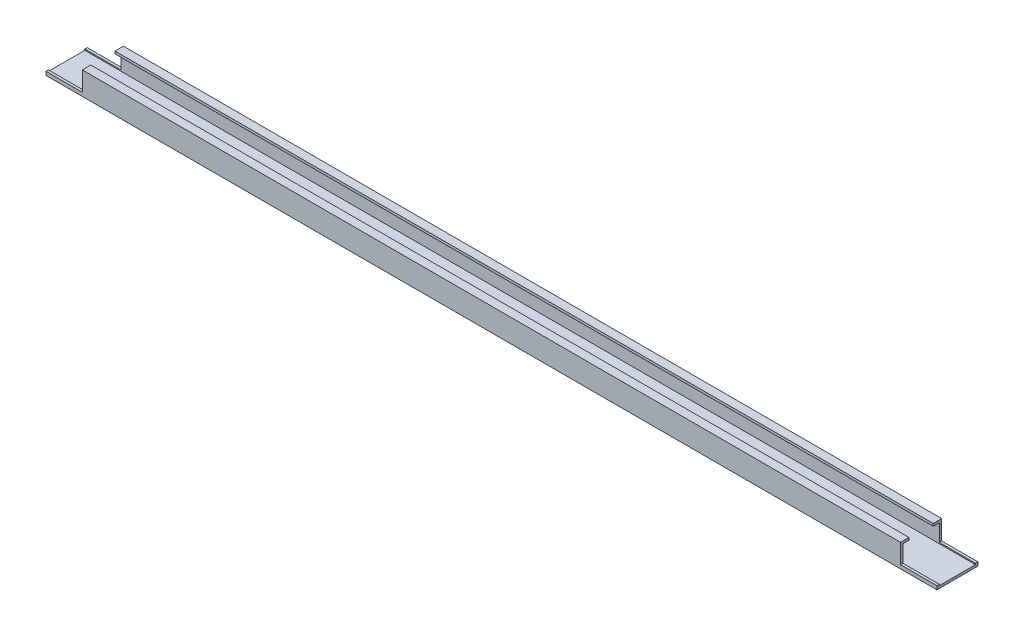
ISO-10303-21;
HEADER;
FILE_DESCRIPTION(('STEP AP214'),'2;1');
FILE_NAME('part.step','',(''),(''),'','','');
FILE_SCHEMA(('AUTOMOTIVE_DESIGN { 1 0 10303 214 1 1 1 1 }'));
ENDSEC;
DATA;
#1=APPLICATION_CONTEXT('core data for automotive mechanical design processes');
#2=APPLICATION_PROTOCOL_DEFINITION('international standard','automotive_design',2000,#1);
#3=PRODUCT_CONTEXT('',#1,'mechanical');
#4=PRODUCT('Part','Part','',(#3));
#5=PRODUCT_RELATED_PRODUCT_CATEGORY('part','',(#4));
#6=PRODUCT_DEFINITION_FORMATION('','',#4);
#7=PRODUCT_DEFINITION_CONTEXT('part definition',#1,'design');
#8=PRODUCT_DEFINITION('design','',#6,#7);
#9=PRODUCT_DEFINITION_SHAPE('','',#8);
#10=(LENGTH_UNIT() NAMED_UNIT(*) SI_UNIT(.MILLI.,.METRE.));
#11=(NAMED_UNIT(*) PLANE_ANGLE_UNIT() SI_UNIT($,.RADIAN.));
#12=(NAMED_UNIT(*) SI_UNIT($,.STERADIAN.) SOLID_ANGLE_UNIT());
#13=UNCERTAINTY_MEASURE_WITH_UNIT(LENGTH_MEASURE(1.E-05),#10,'distance_accuracy_value','');
#14=(GEOMETRIC_REPRESENTATION_CONTEXT(3) GLOBAL_UNCERTAINTY_ASSIGNED_CONTEXT((#13)) GLOBAL_UNIT_ASSIGNED_CONTEXT((#10,
#11,#12)) REPRESENTATION_CONTEXT('',''));
#15=CARTESIAN_POINT('',(0.,0.,0.));
#16=DIRECTION('',(0.,0.,1.));
#17=DIRECTION('',(1.,0.,0.));
#18=AXIS2_PLACEMENT_3D('',#15,#16,#17);
#19=CARTESIAN_POINT('',(736.,17.,-15.));
#20=DIRECTION('',(0.,-1.,0.));
#21=DIRECTION('',(0.,0.,-1.));
#22=AXIS2_PLACEMENT_3D('',#19,#20,#21);
#23=PLANE('',#22);
#24=DIRECTION('',(-1.,0.,0.));
#25=VECTOR('',#24,1.);
#26=CARTESIAN_POINT('',(736.,17.,-10.));
#27=LINE('',#26,#25);
#28=CARTESIAN_POINT('',(706.,17.,-10.));
#29=VERTEX_POINT('',#28);
#30=CARTESIAN_POINT('',(30.,17.,-10.));
#31=VERTEX_POINT('',#30);
#32=EDGE_CURVE('E311',#29,#31,#27,.T.);
#33=ORIENTED_EDGE('',*,*,#32,.F.);
#34=DIRECTION('',(0.,0.,-1.));
#35=VECTOR('',#34,1.);
#36=CARTESIAN_POINT('',(706.,17.,17.));
#37=LINE('',#36,#35);
#38=CARTESIAN_POINT('',(706.,17.,-17.));
#39=VERTEX_POINT('',#38);
#40=EDGE_CURVE('E174',#29,#39,#37,.T.);
#41=ORIENTED_EDGE('',*,*,#40,.T.);
#42=DIRECTION('',(-1.,0.,0.));
#43=VECTOR('',#42,1.);
#44=CARTESIAN_POINT('',(736.,17.,-17.));
#45=LINE('',#44,#43);
#46=CARTESIAN_POINT('',(30.,17.,-17.));
#47=VERTEX_POINT('',#46);
#48=EDGE_CURVE('E267',#39,#47,#45,.T.);
#49=ORIENTED_EDGE('',*,*,#48,.T.);
#50=DIRECTION('',(0.,0.,-1.));
#51=VECTOR('',#50,1.);
#52=CARTESIAN_POINT('',(30.,17.,17.));
#53=LINE('',#52,#51);
#54=EDGE_CURVE('E209',#31,#47,#53,.T.);
#55=ORIENTED_EDGE('',*,*,#54,.F.);
#56=EDGE_LOOP('',(#33,#41,#49,#55));
#57=FACE_BOUND('',#56,.T.);
#58=ADVANCED_FACE('F33',(#57),#23,.F.);
#59=CARTESIAN_POINT('',(736.,15.,-10.));
#60=DIRECTION('',(0.,0.,1.));
#61=DIRECTION('',(1.,0.,0.));
#62=AXIS2_PLACEMENT_3D('',#59,#60,#61);
#63=PLANE('',#62);
#64=DIRECTION('',(0.,-1.,0.));
#65=VECTOR('',#64,1.);
#66=CARTESIAN_POINT('',(706.,15.,-10.));
#67=LINE('',#66,#65);
#68=CARTESIAN_POINT('',(706.,15.,-10.));
#69=VERTEX_POINT('',#68);
#70=EDGE_CURVE('E249',#29,#69,#67,.T.);
#71=ORIENTED_EDGE('',*,*,#70,.F.);
#72=ORIENTED_EDGE('',*,*,#32,.T.);
#73=DIRECTION('',(0.,1.,0.));
#74=VECTOR('',#73,1.);
#75=CARTESIAN_POINT('',(30.,15.0000000000002,-10.));
#76=LINE('',#75,#74);
#77=CARTESIAN_POINT('',(30.,15.,-10.));
#78=VERTEX_POINT('',#77);
#79=EDGE_CURVE('E237',#78,#31,#76,.T.);
#80=ORIENTED_EDGE('',*,*,#79,.F.);
#81=DIRECTION('',(-1.,0.,0.));
#82=VECTOR('',#81,1.);
#83=CARTESIAN_POINT('',(736.,15.,-10.));
#84=LINE('',#83,#82);
#85=EDGE_CURVE('E308',#69,#78,#84,.T.);
#86=ORIENTED_EDGE('',*,*,#85,.F.);
#87=EDGE_LOOP('',(#71,#72,#80,#86));
#88=FACE_BOUND('',#87,.T.);
#89=ADVANCED_FACE('F354',(#88),#63,.T.);
#90=CARTESIAN_POINT('',(736.,15.,-15.));
#91=DIRECTION('',(0.,-1.,0.));
#92=DIRECTION('',(0.,0.,-1.));
#93=AXIS2_PLACEMENT_3D('',#90,#91,#92);
#94=PLANE('',#93);
#95=DIRECTION('',(0.,0.,-1.));
#96=VECTOR('',#95,1.);
#97=CARTESIAN_POINT('',(706.,15.,-15.));
#98=LINE('',#97,#96);
#99=CARTESIAN_POINT('',(706.,15.,-15.));
#100=VERTEX_POINT('',#99);
#101=EDGE_CURVE('E247',#69,#100,#98,.T.);
#102=ORIENTED_EDGE('',*,*,#101,.F.);
#103=ORIENTED_EDGE('',*,*,#85,.T.);
#104=DIRECTION('',(0.,0.,1.));
#105=VECTOR('',#104,1.);
#106=CARTESIAN_POINT('',(30.,15.,-15.));
#107=LINE('',#106,#105);
#108=CARTESIAN_POINT('',(30.,15.,-15.));
#109=VERTEX_POINT('',#108);
#110=EDGE_CURVE('E235',#109,#78,#107,.T.);
#111=ORIENTED_EDGE('',*,*,#110,.F.);
#112=DIRECTION('',(-1.,0.,0.));
#113=VECTOR('',#112,1.);
#114=CARTESIAN_POINT('',(736.,15.,-15.));
#115=LINE('',#114,#113);
#116=EDGE_CURVE('E305',#100,#109,#115,.T.);
#117=ORIENTED_EDGE('',*,*,#116,.F.);
#118=EDGE_LOOP('',(#102,#103,#111,#117));
#119=FACE_BOUND('',#118,.T.);
#120=ADVANCED_FACE('F359',(#119),#94,.T.);
#121=CARTESIAN_POINT('',(736.,0.,-15.));
#122=DIRECTION('',(0.,0.,1.));
#123=DIRECTION('',(1.,0.,0.));
#124=AXIS2_PLACEMENT_3D('',#121,#122,#123);
#125=PLANE('',#124);
#126=DIRECTION('',(0.,-1.,0.));
#127=VECTOR('',#126,1.);
#128=CARTESIAN_POINT('',(706.,0.,-15.));
#129=LINE('',#128,#127);
#130=CARTESIAN_POINT('',(706.,1.,-15.));
#131=VERTEX_POINT('',#130);
#132=EDGE_CURVE('E245',#100,#131,#129,.T.);
#133=ORIENTED_EDGE('',*,*,#132,.F.);
#134=ORIENTED_EDGE('',*,*,#116,.T.);
#135=DIRECTION('',(0.,1.,0.));
#136=VECTOR('',#135,1.);
#137=CARTESIAN_POINT('',(30.,1.53089346754953E-13,-15.));
#138=LINE('',#137,#136);
#139=CARTESIAN_POINT('',(30.,0.999999999999997,-15.));
#140=VERTEX_POINT('',#139);
#141=EDGE_CURVE('E233',#140,#109,#138,.T.);
#142=ORIENTED_EDGE('',*,*,#141,.F.);
#143=DIRECTION('',(1.,0.,0.));
#144=VECTOR('',#143,1.);
#145=CARTESIAN_POINT('',(736.,0.999999999999911,-15.));
#146=LINE('',#145,#144);
#147=CARTESIAN_POINT('',(0.,1.,-15.));
#148=VERTEX_POINT('',#147);
#149=EDGE_CURVE('E223',#148,#140,#146,.T.);
#150=ORIENTED_EDGE('',*,*,#149,.F.);
#151=DIRECTION('',(0.,1.,0.));
#152=VECTOR('',#151,1.);
#153=CARTESIAN_POINT('',(0.,0.,-15.));
#154=LINE('',#153,#152);
#155=CARTESIAN_POINT('',(0.,0.,-15.));
#156=VERTEX_POINT('',#155);
#157=EDGE_CURVE('E251',#156,#148,#154,.T.);
#158=ORIENTED_EDGE('',*,*,#157,.F.);
#159=DIRECTION('',(-1.,0.,0.));
#160=VECTOR('',#159,1.);
#161=CARTESIAN_POINT('',(736.,0.,-15.));
#162=LINE('',#161,#160);
#163=CARTESIAN_POINT('',(736.,0.,-15.));
#164=VERTEX_POINT('',#163);
#165=EDGE_CURVE('E303',#164,#156,#162,.T.);
#166=ORIENTED_EDGE('',*,*,#165,.F.);
#167=DIRECTION('',(0.,1.,0.));
#168=VECTOR('',#167,1.);
#169=CARTESIAN_POINT('',(736.,0.,-15.));
#170=LINE('',#169,#168);
#171=CARTESIAN_POINT('',(736.,1.,-15.));
#172=VERTEX_POINT('',#171);
#173=EDGE_CURVE('E252',#164,#172,#170,.T.);
#174=ORIENTED_EDGE('',*,*,#173,.T.);
#175=DIRECTION('',(1.,0.,0.));
#176=VECTOR('',#175,1.);
#177=CARTESIAN_POINT('',(736.,1.,-15.));
#178=LINE('',#177,#176);
#179=EDGE_CURVE('E55',#131,#172,#178,.T.);
#180=ORIENTED_EDGE('',*,*,#179,.F.);
#181=EDGE_LOOP('',(#133,#134,#142,#150,#158,#166,#174,#180));
#182=FACE_BOUND('',#181,.T.);
#183=ADVANCED_FACE('F325',(#182),#125,.T.);
#184=CARTESIAN_POINT('',(736.,0.,15.));
#185=DIRECTION('',(0.,1.,0.));
#186=DIRECTION('',(0.,0.,1.));
#187=AXIS2_PLACEMENT_3D('',#184,#185,#186);
#188=PLANE('',#187);
#189=DIRECTION('',(0.,0.,-1.));
#190=VECTOR('',#189,1.);
#191=CARTESIAN_POINT('',(0.,0.,15.));
#192=LINE('',#191,#190);
#193=CARTESIAN_POINT('',(0.,0.,15.));
#194=VERTEX_POINT('',#193);
#195=EDGE_CURVE('E270',#194,#156,#192,.T.);
#196=ORIENTED_EDGE('',*,*,#195,.F.);
#197=DIRECTION('',(-1.,0.,0.));
#198=VECTOR('',#197,1.);
#199=CARTESIAN_POINT('',(736.,0.,15.));
#200=LINE('',#199,#198);
#201=CARTESIAN_POINT('',(736.,0.,15.));
#202=VERTEX_POINT('',#201);
#203=EDGE_CURVE('E300',#202,#194,#200,.T.);
#204=ORIENTED_EDGE('',*,*,#203,.F.);
#205=DIRECTION('',(0.,0.,-1.));
#206=VECTOR('',#205,1.);
#207=CARTESIAN_POINT('',(736.,0.,15.));
#208=LINE('',#207,#206);
#209=EDGE_CURVE('E255',#202,#164,#208,.T.);
#210=ORIENTED_EDGE('',*,*,#209,.T.);
#211=ORIENTED_EDGE('',*,*,#165,.T.);
#212=EDGE_LOOP('',(#196,#204,#210,#211));
#213=FACE_BOUND('',#212,.T.);
#214=ADVANCED_FACE('F331',(#213),#188,.T.);
#215=CARTESIAN_POINT('',(736.,0.,15.));
#216=DIRECTION('',(0.,0.,-1.));
#217=DIRECTION('',(-1.,0.,0.));
#218=AXIS2_PLACEMENT_3D('',#215,#216,#217);
#219=PLANE('',#218);
#220=DIRECTION('',(0.,1.,0.));
#221=VECTOR('',#220,1.);
#222=CARTESIAN_POINT('',(706.,0.,15.));
#223=LINE('',#222,#221);
#224=CARTESIAN_POINT('',(706.,1.,15.));
#225=VERTEX_POINT('',#224);
#226=CARTESIAN_POINT('',(706.,15.,15.));
#227=VERTEX_POINT('',#226);
#228=EDGE_CURVE('E243',#225,#227,#223,.T.);
#229=ORIENTED_EDGE('',*,*,#228,.F.);
#230=DIRECTION('',(-1.,0.,0.));
#231=VECTOR('',#230,1.);
#232=CARTESIAN_POINT('',(736.,1.,15.));
#233=LINE('',#232,#231);
#234=CARTESIAN_POINT('',(736.,1.,15.));
#235=VERTEX_POINT('',#234);
#236=EDGE_CURVE('E171',#235,#225,#233,.T.);
#237=ORIENTED_EDGE('',*,*,#236,.F.);
#238=DIRECTION('',(0.,-1.,0.));
#239=VECTOR('',#238,1.);
#240=CARTESIAN_POINT('',(736.,0.,15.));
#241=LINE('',#240,#239);
#242=EDGE_CURVE('E259',#235,#202,#241,.T.);
#243=ORIENTED_EDGE('',*,*,#242,.T.);
#244=ORIENTED_EDGE('',*,*,#203,.T.);
#245=DIRECTION('',(0.,-1.,0.));
#246=VECTOR('',#245,1.);
#247=CARTESIAN_POINT('',(0.,0.,15.));
#248=LINE('',#247,#246);
#249=CARTESIAN_POINT('',(0.,1.,15.));
#250=VERTEX_POINT('',#249);
#251=EDGE_CURVE('E273',#250,#194,#248,.T.);
#252=ORIENTED_EDGE('',*,*,#251,.F.);
#253=DIRECTION('',(-1.,0.,0.));
#254=VECTOR('',#253,1.);
#255=CARTESIAN_POINT('',(736.,0.999999999999911,15.));
#256=LINE('',#255,#254);
#257=CARTESIAN_POINT('',(30.,0.999999999999997,15.));
#258=VERTEX_POINT('',#257);
#259=EDGE_CURVE('E199',#258,#250,#256,.T.);
#260=ORIENTED_EDGE('',*,*,#259,.F.);
#261=DIRECTION('',(0.,-1.,0.));
#262=VECTOR('',#261,1.);
#263=CARTESIAN_POINT('',(30.,1.53089346754953E-13,15.));
#264=LINE('',#263,#262);
#265=CARTESIAN_POINT('',(30.,15.,15.));
#266=VERTEX_POINT('',#265);
#267=EDGE_CURVE('E231',#266,#258,#264,.T.);
#268=ORIENTED_EDGE('',*,*,#267,.F.);
#269=DIRECTION('',(-1.,0.,0.));
#270=VECTOR('',#269,1.);
#271=CARTESIAN_POINT('',(736.,15.,15.));
#272=LINE('',#271,#270);
#273=EDGE_CURVE('E297',#227,#266,#272,.T.);
#274=ORIENTED_EDGE('',*,*,#273,.F.);
#275=EDGE_LOOP('',(#229,#237,#243,#244,#252,#260,#268,#274));
#276=FACE_BOUND('',#275,.T.);
#277=ADVANCED_FACE('F374',(#276),#219,.T.);
#278=CARTESIAN_POINT('',(736.,15.,15.));
#279=DIRECTION('',(0.,-1.,0.));
#280=DIRECTION('',(0.,0.,-1.));
#281=AXIS2_PLACEMENT_3D('',#278,#279,#280);
#282=PLANE('',#281);
#283=DIRECTION('',(0.,0.,-1.));
#284=VECTOR('',#283,1.);
#285=CARTESIAN_POINT('',(706.,15.,15.));
#286=LINE('',#285,#284);
#287=CARTESIAN_POINT('',(706.,15.,10.));
#288=VERTEX_POINT('',#287);
#289=EDGE_CURVE('E241',#227,#288,#286,.T.);
#290=ORIENTED_EDGE('',*,*,#289,.F.);
#291=ORIENTED_EDGE('',*,*,#273,.T.);
#292=DIRECTION('',(0.,0.,1.));
#293=VECTOR('',#292,1.);
#294=CARTESIAN_POINT('',(30.,15.,15.));
#295=LINE('',#294,#293);
#296=CARTESIAN_POINT('',(30.,15.,10.));
#297=VERTEX_POINT('',#296);
#298=EDGE_CURVE('E229',#297,#266,#295,.T.);
#299=ORIENTED_EDGE('',*,*,#298,.F.);
#300=DIRECTION('',(-1.,0.,0.));
#301=VECTOR('',#300,1.);
#302=CARTESIAN_POINT('',(736.,15.,10.));
#303=LINE('',#302,#301);
#304=EDGE_CURVE('E294',#288,#297,#303,.T.);
#305=ORIENTED_EDGE('',*,*,#304,.F.);
#306=EDGE_LOOP('',(#290,#291,#299,#305));
#307=FACE_BOUND('',#306,.T.);
#308=ADVANCED_FACE('F381',(#307),#282,.T.);
#309=CARTESIAN_POINT('',(736.,17.,10.));
#310=DIRECTION('',(0.,0.,-1.));
#311=DIRECTION('',(-1.,0.,0.));
#312=AXIS2_PLACEMENT_3D('',#309,#310,#311);
#313=PLANE('',#312);
#314=DIRECTION('',(0.,1.,0.));
#315=VECTOR('',#314,1.);
#316=CARTESIAN_POINT('',(706.,17.,10.));
#317=LINE('',#316,#315);
#318=CARTESIAN_POINT('',(706.,17.,10.));
#319=VERTEX_POINT('',#318);
#320=EDGE_CURVE('E239',#288,#319,#317,.T.);
#321=ORIENTED_EDGE('',*,*,#320,.F.);
#322=ORIENTED_EDGE('',*,*,#304,.T.);
#323=DIRECTION('',(0.,-1.,0.));
#324=VECTOR('',#323,1.);
#325=CARTESIAN_POINT('',(30.,17.0000000000002,10.));
#326=LINE('',#325,#324);
#327=CARTESIAN_POINT('',(30.,17.,10.));
#328=VERTEX_POINT('',#327);
#329=EDGE_CURVE('E227',#328,#297,#326,.T.);
#330=ORIENTED_EDGE('',*,*,#329,.F.);
#331=DIRECTION('',(-1.,0.,0.));
#332=VECTOR('',#331,1.);
#333=CARTESIAN_POINT('',(736.,17.,10.));
#334=LINE('',#333,#332);
#335=EDGE_CURVE('E291',#319,#328,#334,.T.);
#336=ORIENTED_EDGE('',*,*,#335,.F.);
#337=EDGE_LOOP('',(#321,#322,#330,#336));
#338=FACE_BOUND('',#337,.T.);
#339=ADVANCED_FACE('F385',(#338),#313,.T.);
#340=CARTESIAN_POINT('',(736.,17.,15.));
#341=DIRECTION('',(0.,-1.,0.));
#342=DIRECTION('',(0.,0.,-1.));
#343=AXIS2_PLACEMENT_3D('',#340,#341,#342);
#344=PLANE('',#343);
#345=DIRECTION('',(-1.,0.,0.));
#346=VECTOR('',#345,1.);
#347=CARTESIAN_POINT('',(736.,17.,17.));
#348=LINE('',#347,#346);
#349=CARTESIAN_POINT('',(706.,17.,17.));
#350=VERTEX_POINT('',#349);
#351=CARTESIAN_POINT('',(30.,17.,17.));
#352=VERTEX_POINT('',#351);
#353=EDGE_CURVE('E289',#350,#352,#348,.T.);
#354=ORIENTED_EDGE('',*,*,#353,.F.);
#355=EDGE_CURVE('E181',#350,#319,#37,.T.);
#356=ORIENTED_EDGE('',*,*,#355,.T.);
#357=ORIENTED_EDGE('',*,*,#335,.T.);
#358=EDGE_CURVE('E220',#352,#328,#53,.T.);
#359=ORIENTED_EDGE('',*,*,#358,.F.);
#360=EDGE_LOOP('',(#354,#356,#357,#359));
#361=FACE_BOUND('',#360,.T.);
#362=ADVANCED_FACE('F388',(#361),#344,.F.);
#363=CARTESIAN_POINT('',(736.,0.,17.));
#364=DIRECTION('',(0.,0.,-1.));
#365=DIRECTION('',(-1.,0.,0.));
#366=AXIS2_PLACEMENT_3D('',#363,#364,#365);
#367=PLANE('',#366);
#368=DIRECTION('',(-1.,0.,0.));
#369=VECTOR('',#368,1.);
#370=CARTESIAN_POINT('',(736.,1.,17.));
#371=LINE('',#370,#369);
#372=CARTESIAN_POINT('',(736.,1.,17.));
#373=VERTEX_POINT('',#372);
#374=CARTESIAN_POINT('',(706.,1.,17.));
#375=VERTEX_POINT('',#374);
#376=EDGE_CURVE('E47',#373,#375,#371,.T.);
#377=ORIENTED_EDGE('',*,*,#376,.T.);
#378=DIRECTION('',(0.,1.,0.));
#379=VECTOR('',#378,1.);
#380=CARTESIAN_POINT('',(706.,17.,17.));
#381=LINE('',#380,#379);
#382=EDGE_CURVE('E178',#375,#350,#381,.T.);
#383=ORIENTED_EDGE('',*,*,#382,.T.);
#384=ORIENTED_EDGE('',*,*,#353,.T.);
#385=DIRECTION('',(0.,-1.,0.));
#386=VECTOR('',#385,1.);
#387=CARTESIAN_POINT('',(30.,17.,17.));
#388=LINE('',#387,#386);
#389=CARTESIAN_POINT('',(30.,0.999999999999997,17.));
#390=VERTEX_POINT('',#389);
#391=EDGE_CURVE('E202',#352,#390,#388,.T.);
#392=ORIENTED_EDGE('',*,*,#391,.T.);
#393=DIRECTION('',(-1.,0.,0.));
#394=VECTOR('',#393,1.);
#395=CARTESIAN_POINT('',(0.,1.,17.));
#396=LINE('',#395,#394);
#397=CARTESIAN_POINT('',(0.,1.,17.));
#398=VERTEX_POINT('',#397);
#399=EDGE_CURVE('E205',#390,#398,#396,.T.);
#400=ORIENTED_EDGE('',*,*,#399,.T.);
#401=DIRECTION('',(0.,1.,0.));
#402=VECTOR('',#401,1.);
#403=CARTESIAN_POINT('',(0.,0.,17.));
#404=LINE('',#403,#402);
#405=CARTESIAN_POINT('',(0.,-2.,17.));
#406=VERTEX_POINT('',#405);
#407=EDGE_CURVE('E275',#398,#406,#404,.F.);
#408=ORIENTED_EDGE('',*,*,#407,.T.);
#409=DIRECTION('',(-1.,0.,0.));
#410=VECTOR('',#409,1.);
#411=CARTESIAN_POINT('',(736.,-2.,17.));
#412=LINE('',#411,#410);
#413=CARTESIAN_POINT('',(736.,-2.,17.));
#414=VERTEX_POINT('',#413);
#415=EDGE_CURVE('E286',#414,#406,#412,.T.);
#416=ORIENTED_EDGE('',*,*,#415,.F.);
#417=DIRECTION('',(0.,1.,0.));
#418=VECTOR('',#417,1.);
#419=CARTESIAN_POINT('',(736.,0.,17.));
#420=LINE('',#419,#418);
#421=EDGE_CURVE('E190',#373,#414,#420,.F.);
#422=ORIENTED_EDGE('',*,*,#421,.F.);
#423=EDGE_LOOP('',(#377,#383,#384,#392,#400,#408,#416,#422));
#424=FACE_BOUND('',#423,.T.);
#425=ADVANCED_FACE('F188',(#424),#367,.F.);
#426=CARTESIAN_POINT('',(736.,-2.,15.));
#427=DIRECTION('',(0.,1.,0.));
#428=DIRECTION('',(0.,0.,1.));
#429=AXIS2_PLACEMENT_3D('',#426,#427,#428);
#430=PLANE('',#429);
#431=DIRECTION('',(0.,0.,-1.));
#432=VECTOR('',#431,1.);
#433=CARTESIAN_POINT('',(0.,-2.,15.));
#434=LINE('',#433,#432);
#435=CARTESIAN_POINT('',(0.,-2.,-17.));
#436=VERTEX_POINT('',#435);
#437=EDGE_CURVE('E277',#406,#436,#434,.T.);
#438=ORIENTED_EDGE('',*,*,#437,.T.);
#439=DIRECTION('',(-1.,0.,0.));
#440=VECTOR('',#439,1.);
#441=CARTESIAN_POINT('',(736.,-2.,-17.));
#442=LINE('',#441,#440);
#443=CARTESIAN_POINT('',(736.,-2.,-17.));
#444=VERTEX_POINT('',#443);
#445=EDGE_CURVE('E283',#444,#436,#442,.T.);
#446=ORIENTED_EDGE('',*,*,#445,.F.);
#447=DIRECTION('',(0.,0.,-1.));
#448=VECTOR('',#447,1.);
#449=CARTESIAN_POINT('',(736.,-2.,15.));
#450=LINE('',#449,#448);
#451=EDGE_CURVE('E262',#414,#444,#450,.T.);
#452=ORIENTED_EDGE('',*,*,#451,.F.);
#453=ORIENTED_EDGE('',*,*,#415,.T.);
#454=EDGE_LOOP('',(#438,#446,#452,#453));
#455=FACE_BOUND('',#454,.T.);
#456=ADVANCED_FACE('F367',(#455),#430,.F.);
#457=CARTESIAN_POINT('',(736.,0.,-17.));
#458=DIRECTION('',(0.,0.,1.));
#459=DIRECTION('',(1.,0.,0.));
#460=AXIS2_PLACEMENT_3D('',#457,#458,#459);
#461=PLANE('',#460);
#462=ORIENTED_EDGE('',*,*,#48,.F.);
#463=DIRECTION('',(0.,1.,0.));
#464=VECTOR('',#463,1.);
#465=CARTESIAN_POINT('',(706.,17.,-17.));
#466=LINE('',#465,#464);
#467=CARTESIAN_POINT('',(706.,1.,-17.));
#468=VERTEX_POINT('',#467);
#469=EDGE_CURVE('E191',#468,#39,#466,.T.);
#470=ORIENTED_EDGE('',*,*,#469,.F.);
#471=DIRECTION('',(-1.,0.,0.));
#472=VECTOR('',#471,1.);
#473=CARTESIAN_POINT('',(736.,1.,-17.));
#474=LINE('',#473,#472);
#475=CARTESIAN_POINT('',(736.,1.,-17.));
#476=VERTEX_POINT('',#475);
#477=EDGE_CURVE('E193',#476,#468,#474,.T.);
#478=ORIENTED_EDGE('',*,*,#477,.F.);
#479=DIRECTION('',(0.,1.,0.));
#480=VECTOR('',#479,1.);
#481=CARTESIAN_POINT('',(736.,0.,-17.));
#482=LINE('',#481,#480);
#483=EDGE_CURVE('E264',#444,#476,#482,.T.);
#484=ORIENTED_EDGE('',*,*,#483,.F.);
#485=ORIENTED_EDGE('',*,*,#445,.T.);
#486=DIRECTION('',(0.,1.,0.));
#487=VECTOR('',#486,1.);
#488=CARTESIAN_POINT('',(0.,0.,-17.));
#489=LINE('',#488,#487);
#490=CARTESIAN_POINT('',(0.,0.999999999999997,-17.));
#491=VERTEX_POINT('',#490);
#492=EDGE_CURVE('E256',#436,#491,#489,.T.);
#493=ORIENTED_EDGE('',*,*,#492,.T.);
#494=DIRECTION('',(-1.,0.,0.));
#495=VECTOR('',#494,1.);
#496=CARTESIAN_POINT('',(0.,1.,-17.));
#497=LINE('',#496,#495);
#498=CARTESIAN_POINT('',(30.,0.999999999999997,-17.));
#499=VERTEX_POINT('',#498);
#500=EDGE_CURVE('E206',#499,#491,#497,.T.);
#501=ORIENTED_EDGE('',*,*,#500,.F.);
#502=DIRECTION('',(0.,-1.,0.));
#503=VECTOR('',#502,1.);
#504=CARTESIAN_POINT('',(30.,17.,-17.));
#505=LINE('',#504,#503);
#506=EDGE_CURVE('E210',#47,#499,#505,.T.);
#507=ORIENTED_EDGE('',*,*,#506,.F.);
#508=EDGE_LOOP('',(#462,#470,#478,#484,#485,#493,#501,#507));
#509=FACE_BOUND('',#508,.T.);
#510=ADVANCED_FACE('F343',(#509),#461,.F.);
#511=CARTESIAN_POINT('',(736.,0.,0.));
#512=DIRECTION('',(-1.,0.,0.));
#513=DIRECTION('',(0.,0.,1.));
#514=AXIS2_PLACEMENT_3D('',#511,#512,#513);
#515=PLANE('',#514);
#516=ORIENTED_EDGE('',*,*,#483,.T.);
#517=DIRECTION('',(0.,0.,1.));
#518=VECTOR('',#517,1.);
#519=CARTESIAN_POINT('',(736.,1.,0.));
#520=LINE('',#519,#518);
#521=EDGE_CURVE('E11',#476,#172,#520,.T.);
#522=ORIENTED_EDGE('',*,*,#521,.T.);
#523=ORIENTED_EDGE('',*,*,#173,.F.);
#524=ORIENTED_EDGE('',*,*,#209,.F.);
#525=ORIENTED_EDGE('',*,*,#242,.F.);
#526=DIRECTION('',(0.,0.,-1.));
#527=VECTOR('',#526,1.);
#528=CARTESIAN_POINT('',(736.,1.,17.));
#529=LINE('',#528,#527);
#530=EDGE_CURVE('E185',#373,#235,#529,.T.);
#531=ORIENTED_EDGE('',*,*,#530,.F.);
#532=ORIENTED_EDGE('',*,*,#421,.T.);
#533=ORIENTED_EDGE('',*,*,#451,.T.);
#534=EDGE_LOOP('',(#516,#522,#523,#524,#525,#531,#532,#533));
#535=FACE_BOUND('',#534,.T.);
#536=ADVANCED_FACE('F335',(#535),#515,.F.);
#537=CARTESIAN_POINT('',(0.,0.,0.));
#538=DIRECTION('',(-1.,0.,0.));
#539=DIRECTION('',(0.,0.,1.));
#540=AXIS2_PLACEMENT_3D('',#537,#538,#539);
#541=PLANE('',#540);
#542=DIRECTION('',(0.,0.,1.));
#543=VECTOR('',#542,1.);
#544=CARTESIAN_POINT('',(0.,1.,0.));
#545=LINE('',#544,#543);
#546=EDGE_CURVE('E40',#491,#148,#545,.T.);
#547=ORIENTED_EDGE('',*,*,#546,.F.);
#548=ORIENTED_EDGE('',*,*,#492,.F.);
#549=ORIENTED_EDGE('',*,*,#437,.F.);
#550=ORIENTED_EDGE('',*,*,#407,.F.);
#551=DIRECTION('',(0.,0.,-1.));
#552=VECTOR('',#551,1.);
#553=CARTESIAN_POINT('',(0.,1.,17.));
#554=LINE('',#553,#552);
#555=EDGE_CURVE('E197',#398,#250,#554,.T.);
#556=ORIENTED_EDGE('',*,*,#555,.T.);
#557=ORIENTED_EDGE('',*,*,#251,.T.);
#558=ORIENTED_EDGE('',*,*,#195,.T.);
#559=ORIENTED_EDGE('',*,*,#157,.T.);
#560=EDGE_LOOP('',(#547,#548,#549,#550,#556,#557,#558,#559));
#561=FACE_BOUND('',#560,.T.);
#562=ADVANCED_FACE('F326',(#561),#541,.T.);
#563=CARTESIAN_POINT('',(0.,1.,17.));
#564=DIRECTION('',(0.,-1.,0.));
#565=DIRECTION('',(1.,0.,0.));
#566=AXIS2_PLACEMENT_3D('',#563,#564,#565);
#567=PLANE('',#566);
#568=ORIENTED_EDGE('',*,*,#259,.T.);
#569=ORIENTED_EDGE('',*,*,#555,.F.);
#570=ORIENTED_EDGE('',*,*,#399,.F.);
#571=DIRECTION('',(0.,0.,-1.));
#572=VECTOR('',#571,1.);
#573=CARTESIAN_POINT('',(30.,0.999999999999997,17.));
#574=LINE('',#573,#572);
#575=EDGE_CURVE('E216',#390,#258,#574,.T.);
#576=ORIENTED_EDGE('',*,*,#575,.T.);
#577=EDGE_LOOP('',(#568,#569,#570,#576));
#578=FACE_BOUND('',#577,.T.);
#579=ADVANCED_FACE('F371',(#578),#567,.F.);
#580=CARTESIAN_POINT('',(30.,17.,17.));
#581=DIRECTION('',(1.,0.,0.));
#582=DIRECTION('',(0.,1.,0.));
#583=AXIS2_PLACEMENT_3D('',#580,#581,#582);
#584=PLANE('',#583);
#585=ORIENTED_EDGE('',*,*,#267,.T.);
#586=ORIENTED_EDGE('',*,*,#575,.F.);
#587=ORIENTED_EDGE('',*,*,#391,.F.);
#588=ORIENTED_EDGE('',*,*,#358,.T.);
#589=ORIENTED_EDGE('',*,*,#329,.T.);
#590=ORIENTED_EDGE('',*,*,#298,.T.);
#591=EDGE_LOOP('',(#585,#586,#587,#588,#589,#590));
#592=FACE_BOUND('',#591,.T.);
#593=ADVANCED_FACE('F391',(#592),#584,.F.);
#594=ORIENTED_EDGE('',*,*,#79,.T.);
#595=ORIENTED_EDGE('',*,*,#54,.T.);
#596=ORIENTED_EDGE('',*,*,#506,.T.);
#597=EDGE_CURVE('E219',#140,#499,#574,.T.);
#598=ORIENTED_EDGE('',*,*,#597,.F.);
#599=ORIENTED_EDGE('',*,*,#141,.T.);
#600=ORIENTED_EDGE('',*,*,#110,.T.);
#601=EDGE_LOOP('',(#594,#595,#596,#598,#599,#600));
#602=FACE_BOUND('',#601,.T.);
#603=ADVANCED_FACE('F362',(#602),#584,.F.);
#604=ORIENTED_EDGE('',*,*,#149,.T.);
#605=ORIENTED_EDGE('',*,*,#597,.T.);
#606=ORIENTED_EDGE('',*,*,#500,.T.);
#607=ORIENTED_EDGE('',*,*,#546,.T.);
#608=EDGE_LOOP('',(#604,#605,#606,#607));
#609=FACE_BOUND('',#608,.T.);
#610=ADVANCED_FACE('F316',(#609),#567,.F.);
#611=CARTESIAN_POINT('',(736.,1.,17.));
#612=DIRECTION('',(0.,-1.,0.));
#613=DIRECTION('',(0.,0.,-1.));
#614=AXIS2_PLACEMENT_3D('',#611,#612,#613);
#615=PLANE('',#614);
#616=ORIENTED_EDGE('',*,*,#236,.T.);
#617=DIRECTION('',(0.,0.,-1.));
#618=VECTOR('',#617,1.);
#619=CARTESIAN_POINT('',(706.,1.,17.));
#620=LINE('',#619,#618);
#621=EDGE_CURVE('E167',#375,#225,#620,.T.);
#622=ORIENTED_EDGE('',*,*,#621,.F.);
#623=ORIENTED_EDGE('',*,*,#376,.F.);
#624=ORIENTED_EDGE('',*,*,#530,.T.);
#625=EDGE_LOOP('',(#616,#622,#623,#624));
#626=FACE_BOUND('',#625,.T.);
#627=ADVANCED_FACE('F169',(#626),#615,.F.);
#628=CARTESIAN_POINT('',(706.,17.,17.));
#629=DIRECTION('',(-1.,0.,0.));
#630=DIRECTION('',(0.,0.,1.));
#631=AXIS2_PLACEMENT_3D('',#628,#629,#630);
#632=PLANE('',#631);
#633=ORIENTED_EDGE('',*,*,#228,.T.);
#634=ORIENTED_EDGE('',*,*,#289,.T.);
#635=ORIENTED_EDGE('',*,*,#320,.T.);
#636=ORIENTED_EDGE('',*,*,#355,.F.);
#637=ORIENTED_EDGE('',*,*,#382,.F.);
#638=ORIENTED_EDGE('',*,*,#621,.T.);
#639=EDGE_LOOP('',(#633,#634,#635,#636,#637,#638));
#640=FACE_BOUND('',#639,.T.);
#641=ADVANCED_FACE('F179',(#640),#632,.F.);
#642=ORIENTED_EDGE('',*,*,#70,.T.);
#643=ORIENTED_EDGE('',*,*,#101,.T.);
#644=ORIENTED_EDGE('',*,*,#132,.T.);
#645=EDGE_CURVE('E175',#131,#468,#620,.T.);
#646=ORIENTED_EDGE('',*,*,#645,.T.);
#647=ORIENTED_EDGE('',*,*,#469,.T.);
#648=ORIENTED_EDGE('',*,*,#40,.F.);
#649=EDGE_LOOP('',(#642,#643,#644,#646,#647,#648));
#650=FACE_BOUND('',#649,.T.);
#651=ADVANCED_FACE('F347',(#650),#632,.F.);
#652=ORIENTED_EDGE('',*,*,#179,.T.);
#653=ORIENTED_EDGE('',*,*,#521,.F.);
#654=ORIENTED_EDGE('',*,*,#477,.T.);
#655=ORIENTED_EDGE('',*,*,#645,.F.);
#656=EDGE_LOOP('',(#652,#653,#654,#655));
#657=FACE_BOUND('',#656,.T.);
#658=ADVANCED_FACE('F339',(#657),#615,.F.);
#659=CLOSED_SHELL('',(#58,#89,#120,#183,#214,#277,#308,#339,#362,#425,#456,#510,#536,#562,#579,
#593,#603,#610,#627,#641,#651,#658));
#660=MANIFOLD_SOLID_BREP('B2',#659);
#661=ADVANCED_BREP_SHAPE_REPRESENTATION('',(#18,#660),#14);
#662=SHAPE_DEFINITION_REPRESENTATION(#9,#661);
ENDSEC;
END-ISO-10303-21;
